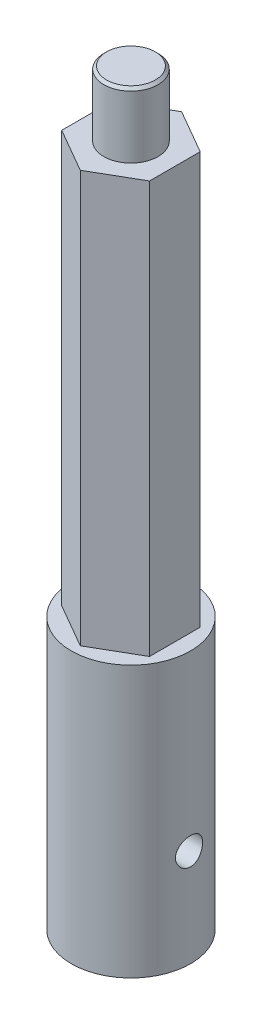
ISO-10303-21;
HEADER;
FILE_DESCRIPTION(('STEP AP214'),'2;1');
FILE_NAME('part.step','',(''),(''),'','','');
FILE_SCHEMA(('AUTOMOTIVE_DESIGN { 1 0 10303 214 1 1 1 1 }'));
ENDSEC;
DATA;
#1=APPLICATION_CONTEXT('core data for automotive mechanical design processes');
#2=APPLICATION_PROTOCOL_DEFINITION('international standard','automotive_design',2000,#1);
#3=PRODUCT_CONTEXT('',#1,'mechanical');
#4=PRODUCT('Part','Part','',(#3));
#5=PRODUCT_RELATED_PRODUCT_CATEGORY('part','',(#4));
#6=PRODUCT_DEFINITION_FORMATION('','',#4);
#7=PRODUCT_DEFINITION_CONTEXT('part definition',#1,'design');
#8=PRODUCT_DEFINITION('design','',#6,#7);
#9=PRODUCT_DEFINITION_SHAPE('','',#8);
#10=(LENGTH_UNIT() NAMED_UNIT(*) SI_UNIT(.MILLI.,.METRE.));
#11=(NAMED_UNIT(*) PLANE_ANGLE_UNIT() SI_UNIT($,.RADIAN.));
#12=(NAMED_UNIT(*) SI_UNIT($,.STERADIAN.) SOLID_ANGLE_UNIT());
#13=UNCERTAINTY_MEASURE_WITH_UNIT(LENGTH_MEASURE(1.E-05),#10,'distance_accuracy_value','');
#14=(GEOMETRIC_REPRESENTATION_CONTEXT(3) GLOBAL_UNCERTAINTY_ASSIGNED_CONTEXT((#13)) GLOBAL_UNIT_ASSIGNED_CONTEXT((#10,
#11,#12)) REPRESENTATION_CONTEXT('',''));
#15=CARTESIAN_POINT('',(0.,0.,0.));
#16=DIRECTION('',(0.,0.,1.));
#17=DIRECTION('',(1.,0.,0.));
#18=AXIS2_PLACEMENT_3D('',#15,#16,#17);
#19=CARTESIAN_POINT('',(2.5,15.,1.6583123951777));
#20=DIRECTION('',(1.,0.,0.));
#21=DIRECTION('',(0.,0.,-1.));
#22=AXIS2_PLACEMENT_3D('',#19,#20,#21);
#23=PLANE('',#22);
#24=CARTESIAN_POINT('',(2.5,9.,0.));
#25=DIRECTION('',(-1.,0.,0.));
#26=DIRECTION('',(0.,0.,1.));
#27=AXIS2_PLACEMENT_3D('',#24,#25,#26);
#28=CIRCLE('',#27,1.24999999999999);
#29=CARTESIAN_POINT('',(2.5,9.,1.24999999999999));
#30=VERTEX_POINT('',#29);
#31=EDGE_CURVE('E222',#30,#30,#28,.T.);
#32=ORIENTED_EDGE('',*,*,#31,.F.);
#33=EDGE_LOOP('',(#32));
#34=FACE_BOUND('',#33,.T.);
#35=DIRECTION('',(0.,0.,-1.));
#36=VECTOR('',#35,1.);
#37=CARTESIAN_POINT('',(2.5,3.,1.6583123951777));
#38=LINE('',#37,#36);
#39=CARTESIAN_POINT('',(2.5,3.,1.6583123951777));
#40=VERTEX_POINT('',#39);
#41=CARTESIAN_POINT('',(2.5,3.,-1.6583123951777));
#42=VERTEX_POINT('',#41);
#43=EDGE_CURVE('E11',#40,#42,#38,.T.);
#44=ORIENTED_EDGE('',*,*,#43,.F.);
#45=DIRECTION('',(0.,-1.,0.));
#46=VECTOR('',#45,1.);
#47=CARTESIAN_POINT('',(2.5,15.,1.6583123951777));
#48=LINE('',#47,#46);
#49=CARTESIAN_POINT('',(2.5,15.,1.6583123951777));
#50=VERTEX_POINT('',#49);
#51=EDGE_CURVE('E107',#50,#40,#48,.T.);
#52=ORIENTED_EDGE('',*,*,#51,.F.);
#53=DIRECTION('',(0.,0.,1.));
#54=VECTOR('',#53,1.);
#55=CARTESIAN_POINT('',(2.5,15.,1.6583123951777));
#56=LINE('',#55,#54);
#57=CARTESIAN_POINT('',(2.5,15.,-1.6583123951777));
#58=VERTEX_POINT('',#57);
#59=EDGE_CURVE('E113',#58,#50,#56,.T.);
#60=ORIENTED_EDGE('',*,*,#59,.F.);
#61=DIRECTION('',(0.,-1.,0.));
#62=VECTOR('',#61,1.);
#63=CARTESIAN_POINT('',(2.5,15.,-1.6583123951777));
#64=LINE('',#63,#62);
#65=EDGE_CURVE('E105',#58,#42,#64,.T.);
#66=ORIENTED_EDGE('',*,*,#65,.T.);
#67=EDGE_LOOP('',(#44,#52,#60,#66));
#68=FACE_BOUND('',#67,.T.);
#69=ADVANCED_FACE('F36',(#34,#68),#23,.F.);
#70=CARTESIAN_POINT('',(0.,63.,0.));
#71=DIRECTION('',(0.,1.,0.));
#72=DIRECTION('',(0.,0.,1.));
#73=AXIS2_PLACEMENT_3D('',#70,#71,#72);
#74=PLANE('',#73);
#75=DIRECTION('',(0.866025403784439,0.,0.5));
#76=VECTOR('',#75,1.);
#77=CARTESIAN_POINT('',(-4.05,63.,2.33826859021798));
#78=LINE('',#77,#76);
#79=CARTESIAN_POINT('',(-4.05,63.,2.33826859021798));
#80=VERTEX_POINT('',#79);
#81=CARTESIAN_POINT('',(0.,63.,4.67653718043597));
#82=VERTEX_POINT('',#81);
#83=EDGE_CURVE('E124',#80,#82,#78,.T.);
#84=ORIENTED_EDGE('',*,*,#83,.T.);
#85=DIRECTION('',(0.866025403784439,0.,-0.5));
#86=VECTOR('',#85,1.);
#87=CARTESIAN_POINT('',(0.,63.,4.67653718043597));
#88=LINE('',#87,#86);
#89=CARTESIAN_POINT('',(4.05,63.,2.33826859021799));
#90=VERTEX_POINT('',#89);
#91=EDGE_CURVE('E127',#82,#90,#88,.T.);
#92=ORIENTED_EDGE('',*,*,#91,.T.);
#93=DIRECTION('',(0.,0.,-1.));
#94=VECTOR('',#93,1.);
#95=CARTESIAN_POINT('',(4.05,63.,2.33826859021799));
#96=LINE('',#95,#94);
#97=CARTESIAN_POINT('',(4.05,63.,-2.33826859021799));
#98=VERTEX_POINT('',#97);
#99=EDGE_CURVE('E130',#90,#98,#96,.T.);
#100=ORIENTED_EDGE('',*,*,#99,.T.);
#101=DIRECTION('',(-0.866025403784439,0.,-0.5));
#102=VECTOR('',#101,1.);
#103=CARTESIAN_POINT('',(4.05,63.,-2.33826859021799));
#104=LINE('',#103,#102);
#105=CARTESIAN_POINT('',(0.,63.,-4.67653718043597));
#106=VERTEX_POINT('',#105);
#107=EDGE_CURVE('E132',#98,#106,#104,.T.);
#108=ORIENTED_EDGE('',*,*,#107,.T.);
#109=DIRECTION('',(-0.866025403784439,0.,0.5));
#110=VECTOR('',#109,1.);
#111=CARTESIAN_POINT('',(0.,63.,-4.67653718043597));
#112=LINE('',#111,#110);
#113=CARTESIAN_POINT('',(-4.05,63.,-2.33826859021798));
#114=VERTEX_POINT('',#113);
#115=EDGE_CURVE('E134',#106,#114,#112,.T.);
#116=ORIENTED_EDGE('',*,*,#115,.T.);
#117=DIRECTION('',(0.,0.,1.));
#118=VECTOR('',#117,1.);
#119=CARTESIAN_POINT('',(-4.05,63.,-2.33826859021798));
#120=LINE('',#119,#118);
#121=EDGE_CURVE('E136',#114,#80,#120,.T.);
#122=ORIENTED_EDGE('',*,*,#121,.T.);
#123=EDGE_LOOP('',(#84,#92,#100,#108,#116,#122));
#124=FACE_BOUND('',#123,.T.);
#125=CARTESIAN_POINT('',(0.,63.,0.));
#126=DIRECTION('',(0.,1.,0.));
#127=DIRECTION('',(0.,0.,1.));
#128=AXIS2_PLACEMENT_3D('',#125,#126,#127);
#129=CIRCLE('',#128,2.5);
#130=CARTESIAN_POINT('',(0.,63.,2.5));
#131=VERTEX_POINT('',#130);
#132=EDGE_CURVE('E115',#131,#131,#129,.T.);
#133=ORIENTED_EDGE('',*,*,#132,.F.);
#134=EDGE_LOOP('',(#133));
#135=FACE_BOUND('',#134,.T.);
#136=ADVANCED_FACE('F192',(#124,#135),#74,.T.);
#137=CARTESIAN_POINT('',(0.,25.,0.));
#138=DIRECTION('',(0.,1.,0.));
#139=DIRECTION('',(0.,0.,1.));
#140=AXIS2_PLACEMENT_3D('',#137,#138,#139);
#141=PLANE('',#140);
#142=CARTESIAN_POINT('',(0.,25.,0.));
#143=DIRECTION('',(0.,1.,0.));
#144=DIRECTION('',(0.,0.,1.));
#145=AXIS2_PLACEMENT_3D('',#142,#143,#144);
#146=CIRCLE('',#145,5.5);
#147=CARTESIAN_POINT('',(0.,25.,5.5));
#148=VERTEX_POINT('',#147);
#149=EDGE_CURVE('E165',#148,#148,#146,.T.);
#150=ORIENTED_EDGE('',*,*,#149,.T.);
#151=EDGE_LOOP('',(#150));
#152=FACE_BOUND('',#151,.T.);
#153=DIRECTION('',(0.866025403784439,0.,-0.5));
#154=VECTOR('',#153,1.);
#155=CARTESIAN_POINT('',(0.,25.,4.67653718043597));
#156=LINE('',#155,#154);
#157=CARTESIAN_POINT('',(0.,25.,4.67653718043597));
#158=VERTEX_POINT('',#157);
#159=CARTESIAN_POINT('',(4.05,25.,2.33826859021799));
#160=VERTEX_POINT('',#159);
#161=EDGE_CURVE('E141',#158,#160,#156,.T.);
#162=ORIENTED_EDGE('',*,*,#161,.F.);
#163=DIRECTION('',(0.866025403784439,0.,0.5));
#164=VECTOR('',#163,1.);
#165=CARTESIAN_POINT('',(-4.05,25.,2.33826859021798));
#166=LINE('',#165,#164);
#167=CARTESIAN_POINT('',(-4.05,25.,2.33826859021798));
#168=VERTEX_POINT('',#167);
#169=EDGE_CURVE('E123',#168,#158,#166,.T.);
#170=ORIENTED_EDGE('',*,*,#169,.F.);
#171=DIRECTION('',(0.,0.,1.));
#172=VECTOR('',#171,1.);
#173=CARTESIAN_POINT('',(-4.05,25.,-2.33826859021798));
#174=LINE('',#173,#172);
#175=CARTESIAN_POINT('',(-4.05,25.,-2.33826859021798));
#176=VERTEX_POINT('',#175);
#177=EDGE_CURVE('E128',#176,#168,#174,.T.);
#178=ORIENTED_EDGE('',*,*,#177,.F.);
#179=DIRECTION('',(-0.866025403784439,0.,0.5));
#180=VECTOR('',#179,1.);
#181=CARTESIAN_POINT('',(0.,25.,-4.67653718043597));
#182=LINE('',#181,#180);
#183=CARTESIAN_POINT('',(0.,25.,-4.67653718043597));
#184=VERTEX_POINT('',#183);
#185=EDGE_CURVE('E147',#184,#176,#182,.T.);
#186=ORIENTED_EDGE('',*,*,#185,.F.);
#187=DIRECTION('',(-0.866025403784439,0.,-0.5));
#188=VECTOR('',#187,1.);
#189=CARTESIAN_POINT('',(4.05,25.,-2.33826859021799));
#190=LINE('',#189,#188);
#191=CARTESIAN_POINT('',(4.05,25.,-2.33826859021799));
#192=VERTEX_POINT('',#191);
#193=EDGE_CURVE('E145',#192,#184,#190,.T.);
#194=ORIENTED_EDGE('',*,*,#193,.F.);
#195=DIRECTION('',(0.,0.,-1.));
#196=VECTOR('',#195,1.);
#197=CARTESIAN_POINT('',(4.05,25.,2.33826859021799));
#198=LINE('',#197,#196);
#199=EDGE_CURVE('E143',#160,#192,#198,.T.);
#200=ORIENTED_EDGE('',*,*,#199,.F.);
#201=EDGE_LOOP('',(#162,#170,#178,#186,#194,#200));
#202=FACE_BOUND('',#201,.T.);
#203=ADVANCED_FACE('F198',(#152,#202),#141,.T.);
#204=CARTESIAN_POINT('',(0.,25.,0.));
#205=DIRECTION('',(0.,-1.,0.));
#206=DIRECTION('',(0.,0.,-1.));
#207=AXIS2_PLACEMENT_3D('',#204,#205,#206);
#208=CYLINDRICAL_SURFACE('',#207,5.5);
#209=CARTESIAN_POINT('',(5.35607132140714,9.,1.24999999999999));
#210=CARTESIAN_POINT('',(5.35607271569806,9.06923309547632,1.24999771619422));
#211=CARTESIAN_POINT('',(5.35742832363105,9.13849304116834,1.24422856166961));
#212=CARTESIAN_POINT('',(5.36269332424885,9.27503828752842,1.2213326011839));
#213=CARTESIAN_POINT('',(5.3666044684747,9.34232220076731,1.20419800533182));
#214=CARTESIAN_POINT('',(5.3765152232523,9.47292052918666,1.15914270188604));
#215=CARTESIAN_POINT('',(5.38251243679928,9.53623940229246,1.13123436986437));
#216=CARTESIAN_POINT('',(5.39591668787014,9.65729919984067,1.0654598749522));
#217=CARTESIAN_POINT('',(5.4033237199606,9.71504014577908,1.0275937504387));
#218=CARTESIAN_POINT('',(5.41886390208649,9.82435774043544,0.942242640179423));
#219=CARTESIAN_POINT('',(5.42700696073142,9.87581789020527,0.894610220101116));
#220=CARTESIAN_POINT('',(5.44301514430799,9.97009125255459,0.791396730287177));
#221=CARTESIAN_POINT('',(5.45088024650588,10.0129037591972,0.735815012255045));
#222=CARTESIAN_POINT('',(5.465554705025,10.089131524136,0.617495106422171));
#223=CARTESIAN_POINT('',(5.47235100492417,10.1224341002153,0.554682564129413));
#224=CARTESIAN_POINT('',(5.48400988207614,10.1779667092065,0.424171927818219));
#225=CARTESIAN_POINT('',(5.48887269393571,10.2001980855652,0.356474427712259));
#226=CARTESIAN_POINT('',(5.49604666041601,10.2325890478744,0.219327796948698));
#227=CARTESIAN_POINT('',(5.49839948403379,10.2429459886787,0.149927493751898));
#228=CARTESIAN_POINT('',(5.50043296396436,10.2519117665406,0.0103372295205213));
#229=CARTESIAN_POINT('',(5.50011394929908,10.250522050133,-0.0598526332211519));
#230=CARTESIAN_POINT('',(5.49687132737987,10.2361796357133,-0.19766693545602));
#231=CARTESIAN_POINT('',(5.4939956555269,10.2234397359931,-0.265314815812263));
#232=CARTESIAN_POINT('',(5.48601775047252,10.1870984601743,-0.397486515579178));
#233=CARTESIAN_POINT('',(5.48091541149934,10.1634965681033,-0.462010186421012));
#234=CARTESIAN_POINT('',(5.4689813591498,10.1059172950664,-0.586684721878418));
#235=CARTESIAN_POINT('',(5.46213648824824,10.0718605496321,-0.646797621996532));
#236=CARTESIAN_POINT('',(5.44746585730485,9.99439774402204,-0.760531999783075));
#237=CARTESIAN_POINT('',(5.43963995384659,9.95099031620901,-0.814152526078437));
#238=CARTESIAN_POINT('',(5.42365855332192,9.85490429216835,-0.914646772136767));
#239=CARTESIAN_POINT('',(5.41549960097905,9.8020394945998,-0.961342074892386));
#240=CARTESIAN_POINT('',(5.39993520224881,9.68914459213129,-1.04523960036566));
#241=CARTESIAN_POINT('',(5.39252977972439,9.62911426044246,-1.08244152250121));
#242=CARTESIAN_POINT('',(5.37930083956819,9.50328800594513,-1.14638443688917));
#243=CARTESIAN_POINT('',(5.37348280157186,9.4374731230401,-1.17308932984504));
#244=CARTESIAN_POINT('',(5.36416156133669,9.30212572313035,-1.21500479464695));
#245=CARTESIAN_POINT('',(5.36065795929618,9.23259385045235,-1.23021735177407));
#246=CARTESIAN_POINT('',(5.35644447103176,9.09342287616907,-1.24843460096687));
#247=CARTESIAN_POINT('',(5.35567490508626,9.02381968359314,-1.25170012601046));
#248=CARTESIAN_POINT('',(5.35685524946336,8.88506339592736,-1.24663886357907));
#249=CARTESIAN_POINT('',(5.35880495678504,8.81591026762621,-1.2383129414362));
#250=CARTESIAN_POINT('',(5.36514758668855,8.68094085309581,-1.21053208830858));
#251=CARTESIAN_POINT('',(5.36950848562745,8.61509291659709,-1.19122293373318));
#252=CARTESIAN_POINT('',(5.38015285157009,8.48756720378463,-1.14218254768221));
#253=CARTESIAN_POINT('',(5.38643651447105,8.42588985316539,-1.11245025421961));
#254=CARTESIAN_POINT('',(5.40034808671371,8.30733348048033,-1.04284048047498));
#255=CARTESIAN_POINT('',(5.4079964833553,8.25055053047956,-1.00280355444637));
#256=CARTESIAN_POINT('',(5.42372272229399,8.14441334837699,-0.913927790878062));
#257=CARTESIAN_POINT('',(5.43180062228642,8.09506011774067,-0.865087768698981));
#258=CARTESIAN_POINT('',(5.44767387128745,8.00415945099209,-0.758807449059136));
#259=CARTESIAN_POINT('',(5.45546017266619,7.96279053763961,-0.701212876613625));
#260=CARTESIAN_POINT('',(5.46970150039047,7.89031459284748,-0.579740838143492));
#261=CARTESIAN_POINT('',(5.47615659136063,7.85920706321723,-0.515863677334323));
#262=CARTESIAN_POINT('',(5.48697029299492,7.80837979446002,-0.384052524657952));
#263=CARTESIAN_POINT('',(5.49134271843123,7.78858483630055,-0.316148723135446));
#264=CARTESIAN_POINT('',(5.49755837946589,7.76071172632286,-0.177868141541237));
#265=CARTESIAN_POINT('',(5.49940201371996,7.75263172766785,-0.107491753059364));
#266=CARTESIAN_POINT('',(5.50033936514418,7.74850644191406,0.0320463213642788));
#267=CARTESIAN_POINT('',(5.49949379441287,7.75219546074704,0.101199876219377));
#268=CARTESIAN_POINT('',(5.495279008056,7.77090547433905,0.237873894864678));
#269=CARTESIAN_POINT('',(5.49190984501223,7.78592623298895,0.305394392651151));
#270=CARTESIAN_POINT('',(5.48303224132098,7.82674181960574,0.436661017109416));
#271=CARTESIAN_POINT('',(5.47753183277209,7.852496222551,0.500420291420023));
#272=CARTESIAN_POINT('',(5.46497684589025,7.91400961342981,0.622746579339578));
#273=CARTESIAN_POINT('',(5.4579221040757,7.94976965384277,0.681313045870216));
#274=CARTESIAN_POINT('',(5.44284675668577,8.03113098232257,0.792878151421584));
#275=CARTESIAN_POINT('',(5.43480943945445,8.0769174572029,0.84573949073395));
#276=CARTESIAN_POINT('',(5.41876069975522,8.1766619851446,0.943119149892998));
#277=CARTESIAN_POINT('',(5.41074928407657,8.23062202727645,0.987635433020151));
#278=CARTESIAN_POINT('',(5.39552746381206,8.34613599692265,1.06769503602716));
#279=CARTESIAN_POINT('',(5.38833055874737,8.40778985648453,1.10309689858481));
#280=CARTESIAN_POINT('',(5.37572512012673,8.53632442568582,1.16298018793326));
#281=CARTESIAN_POINT('',(5.3703151279975,8.60320081700536,1.1874705270155));
#282=CARTESIAN_POINT('',(5.36285672020335,8.72508397872557,1.22064955230648));
#283=CARTESIAN_POINT('',(5.36032965084645,8.77944808628431,1.23163414148621));
#284=CARTESIAN_POINT('',(5.35693644077948,8.88920243590729,1.24631007168686));
#285=CARTESIAN_POINT('',(5.35607020555341,8.94459261939768,1.25000182773418));
#286=CARTESIAN_POINT('',(5.35607132140714,9.,1.24999999999999));
#287=B_SPLINE_CURVE_WITH_KNOTS('',3,(#209,#210,#211,#212,#213,#214,#215,#216,#217,#218,#219,
#220,#221,#222,#223,#224,#225,#226,#227,#228,#229,#230,#231,#232,#233,#234,#235,#236,#237,#238,
#239,#240,#241,#242,#243,#244,#245,#246,#247,#248,#249,#250,#251,#252,#253,#254,#255,#256,#257,
#258,#259,#260,#261,#262,#263,#264,#265,#266,#267,#268,#269,#270,#271,#272,#273,#274,#275,#276,
#277,#278,#279,#280,#281,#282,#283,#284,#285,#286),.UNSPECIFIED.,.T.,.F.,(4,2,2,2,2,2,2,2,2,2,2,
2,2,2,2,2,2,2,2,2,2,2,2,2,2,2,2,2,2,2,2,2,2,2,2,2,2,2,4),(0.,0.207496121650813,
0.415134608622388,0.622535291788398,0.829935175650528,1.04073318636021,1.25154839828979,
1.46476669375053,1.67795910969755,1.88755439091891,2.09712386203479,2.30284503333659,
2.50857597792602,2.71590898418402,2.92327233572577,3.13528932547435,3.3473130273321,
3.56005962984429,3.77276947234057,3.9808066511518,4.18882830027154,4.39415131138949,
4.59949524842832,4.80823060479208,5.01699407183281,5.22998962990618,5.44297484551384,
5.65452690065782,5.86604560147261,6.07282318924712,6.27959646870453,6.48559793754362,
6.69162108354877,6.90183008119011,7.11209031646656,7.32544005280885,7.53861520890217,
7.70468420860325,7.87074375724417),.UNSPECIFIED.);
#288=CARTESIAN_POINT('',(5.35607132140714,9.,1.24999999999999));
#289=VERTEX_POINT('',#288);
#290=EDGE_CURVE('E109',#289,#289,#287,.T.);
#291=ORIENTED_EDGE('',*,*,#290,.T.);
#292=EDGE_LOOP('',(#291));
#293=FACE_BOUND('',#292,.T.);
#294=ORIENTED_EDGE('',*,*,#149,.F.);
#295=EDGE_LOOP('',(#294));
#296=FACE_BOUND('',#295,.T.);
#297=CARTESIAN_POINT('',(0.,0.,0.));
#298=DIRECTION('',(0.,1.,0.));
#299=DIRECTION('',(0.,0.,1.));
#300=AXIS2_PLACEMENT_3D('',#297,#298,#299);
#301=CIRCLE('',#300,5.5);
#302=CARTESIAN_POINT('',(0.,0.,5.5));
#303=VERTEX_POINT('',#302);
#304=EDGE_CURVE('E164',#303,#303,#301,.T.);
#305=ORIENTED_EDGE('',*,*,#304,.T.);
#306=EDGE_LOOP('',(#305));
#307=FACE_BOUND('',#306,.T.);
#308=ADVANCED_FACE('F235',(#293,#296,#307),#208,.T.);
#309=CARTESIAN_POINT('',(0.,0.,0.));
#310=DIRECTION('',(0.,1.,0.));
#311=DIRECTION('',(0.,0.,1.));
#312=AXIS2_PLACEMENT_3D('',#309,#310,#311);
#313=PLANE('',#312);
#314=CARTESIAN_POINT('',(0.,0.,0.));
#315=DIRECTION('',(0.,-1.,0.));
#316=DIRECTION('',(0.,0.,-1.));
#317=AXIS2_PLACEMENT_3D('',#314,#315,#316);
#318=CIRCLE('',#317,3.);
#319=CARTESIAN_POINT('',(0.,0.,-3.));
#320=VERTEX_POINT('',#319);
#321=EDGE_CURVE('E108',#320,#320,#318,.T.);
#322=ORIENTED_EDGE('',*,*,#321,.F.);
#323=EDGE_LOOP('',(#322));
#324=FACE_BOUND('',#323,.T.);
#325=ORIENTED_EDGE('',*,*,#304,.F.);
#326=EDGE_LOOP('',(#325));
#327=FACE_BOUND('',#326,.T.);
#328=ADVANCED_FACE('F238',(#324,#327),#313,.F.);
#329=CARTESIAN_POINT('',(-4.05,63.,2.33826859021798));
#330=DIRECTION('',(0.5,0.,-0.866025403784439));
#331=DIRECTION('',(-0.866025403784439,0.,-0.5));
#332=AXIS2_PLACEMENT_3D('',#329,#330,#331);
#333=PLANE('',#332);
#334=ORIENTED_EDGE('',*,*,#169,.T.);
#335=DIRECTION('',(0.,-1.,0.));
#336=VECTOR('',#335,1.);
#337=CARTESIAN_POINT('',(0.,63.,4.67653718043597));
#338=LINE('',#337,#336);
#339=EDGE_CURVE('E162',#82,#158,#338,.T.);
#340=ORIENTED_EDGE('',*,*,#339,.F.);
#341=ORIENTED_EDGE('',*,*,#83,.F.);
#342=DIRECTION('',(0.,-1.,0.));
#343=VECTOR('',#342,1.);
#344=CARTESIAN_POINT('',(-4.05,63.,2.33826859021798));
#345=LINE('',#344,#343);
#346=EDGE_CURVE('E138',#80,#168,#345,.T.);
#347=ORIENTED_EDGE('',*,*,#346,.T.);
#348=EDGE_LOOP('',(#334,#340,#341,#347));
#349=FACE_BOUND('',#348,.T.);
#350=ADVANCED_FACE('F244',(#349),#333,.F.);
#351=CARTESIAN_POINT('',(0.,63.,4.67653718043597));
#352=DIRECTION('',(-0.5,0.,-0.866025403784439));
#353=DIRECTION('',(-0.866025403784439,0.,0.5));
#354=AXIS2_PLACEMENT_3D('',#351,#352,#353);
#355=PLANE('',#354);
#356=ORIENTED_EDGE('',*,*,#161,.T.);
#357=DIRECTION('',(0.,-1.,0.));
#358=VECTOR('',#357,1.);
#359=CARTESIAN_POINT('',(4.05,63.,2.33826859021799));
#360=LINE('',#359,#358);
#361=EDGE_CURVE('E159',#90,#160,#360,.T.);
#362=ORIENTED_EDGE('',*,*,#361,.F.);
#363=ORIENTED_EDGE('',*,*,#91,.F.);
#364=ORIENTED_EDGE('',*,*,#339,.T.);
#365=EDGE_LOOP('',(#356,#362,#363,#364));
#366=FACE_BOUND('',#365,.T.);
#367=ADVANCED_FACE('F249',(#366),#355,.F.);
#368=CARTESIAN_POINT('',(4.05,63.,2.33826859021799));
#369=DIRECTION('',(-1.,0.,0.));
#370=DIRECTION('',(0.,0.,1.));
#371=AXIS2_PLACEMENT_3D('',#368,#369,#370);
#372=PLANE('',#371);
#373=ORIENTED_EDGE('',*,*,#199,.T.);
#374=DIRECTION('',(0.,-1.,0.));
#375=VECTOR('',#374,1.);
#376=CARTESIAN_POINT('',(4.05,63.,-2.33826859021799));
#377=LINE('',#376,#375);
#378=EDGE_CURVE('E156',#98,#192,#377,.T.);
#379=ORIENTED_EDGE('',*,*,#378,.F.);
#380=ORIENTED_EDGE('',*,*,#99,.F.);
#381=ORIENTED_EDGE('',*,*,#361,.T.);
#382=EDGE_LOOP('',(#373,#379,#380,#381));
#383=FACE_BOUND('',#382,.T.);
#384=ADVANCED_FACE('F258',(#383),#372,.F.);
#385=CARTESIAN_POINT('',(4.05,63.,-2.33826859021799));
#386=DIRECTION('',(-0.5,0.,0.866025403784439));
#387=DIRECTION('',(0.866025403784439,0.,0.5));
#388=AXIS2_PLACEMENT_3D('',#385,#386,#387);
#389=PLANE('',#388);
#390=ORIENTED_EDGE('',*,*,#193,.T.);
#391=DIRECTION('',(0.,-1.,0.));
#392=VECTOR('',#391,1.);
#393=CARTESIAN_POINT('',(0.,63.,-4.67653718043597));
#394=LINE('',#393,#392);
#395=EDGE_CURVE('E153',#106,#184,#394,.T.);
#396=ORIENTED_EDGE('',*,*,#395,.F.);
#397=ORIENTED_EDGE('',*,*,#107,.F.);
#398=ORIENTED_EDGE('',*,*,#378,.T.);
#399=EDGE_LOOP('',(#390,#396,#397,#398));
#400=FACE_BOUND('',#399,.T.);
#401=ADVANCED_FACE('F262',(#400),#389,.F.);
#402=CARTESIAN_POINT('',(0.,63.,-4.67653718043597));
#403=DIRECTION('',(0.5,0.,0.866025403784439));
#404=DIRECTION('',(0.866025403784439,0.,-0.5));
#405=AXIS2_PLACEMENT_3D('',#402,#403,#404);
#406=PLANE('',#405);
#407=ORIENTED_EDGE('',*,*,#185,.T.);
#408=DIRECTION('',(0.,-1.,0.));
#409=VECTOR('',#408,1.);
#410=CARTESIAN_POINT('',(-4.05,63.,-2.33826859021798));
#411=LINE('',#410,#409);
#412=EDGE_CURVE('E57',#114,#176,#411,.T.);
#413=ORIENTED_EDGE('',*,*,#412,.F.);
#414=ORIENTED_EDGE('',*,*,#115,.F.);
#415=ORIENTED_EDGE('',*,*,#395,.T.);
#416=EDGE_LOOP('',(#407,#413,#414,#415));
#417=FACE_BOUND('',#416,.T.);
#418=ADVANCED_FACE('F266',(#417),#406,.F.);
#419=CARTESIAN_POINT('',(-4.05,63.,-2.33826859021798));
#420=DIRECTION('',(1.,0.,0.));
#421=DIRECTION('',(0.,0.,-1.));
#422=AXIS2_PLACEMENT_3D('',#419,#420,#421);
#423=PLANE('',#422);
#424=ORIENTED_EDGE('',*,*,#177,.T.);
#425=ORIENTED_EDGE('',*,*,#346,.F.);
#426=ORIENTED_EDGE('',*,*,#121,.F.);
#427=ORIENTED_EDGE('',*,*,#412,.T.);
#428=EDGE_LOOP('',(#424,#425,#426,#427));
#429=FACE_BOUND('',#428,.T.);
#430=ADVANCED_FACE('F188',(#429),#423,.F.);
#431=CARTESIAN_POINT('',(0.,69.,0.));
#432=DIRECTION('',(0.,-1.,0.));
#433=DIRECTION('',(0.,0.,-1.));
#434=AXIS2_PLACEMENT_3D('',#431,#432,#433);
#435=CYLINDRICAL_SURFACE('',#434,2.5);
#436=CARTESIAN_POINT('',(0.,68.75,0.));
#437=DIRECTION('',(0.,1.,0.));
#438=DIRECTION('',(0.,0.,1.));
#439=AXIS2_PLACEMENT_3D('',#436,#437,#438);
#440=CIRCLE('',#439,2.5);
#441=CARTESIAN_POINT('',(0.,68.75,2.5));
#442=VERTEX_POINT('',#441);
#443=EDGE_CURVE('E44',#442,#442,#440,.F.);
#444=ORIENTED_EDGE('',*,*,#443,.T.);
#445=EDGE_LOOP('',(#444));
#446=FACE_BOUND('',#445,.T.);
#447=ORIENTED_EDGE('',*,*,#132,.T.);
#448=EDGE_LOOP('',(#447));
#449=FACE_BOUND('',#448,.T.);
#450=ADVANCED_FACE('F175',(#446,#449),#435,.T.);
#451=CARTESIAN_POINT('',(0.,69.,0.));
#452=DIRECTION('',(0.,1.,0.));
#453=DIRECTION('',(0.,0.,1.));
#454=AXIS2_PLACEMENT_3D('',#451,#452,#453);
#455=PLANE('',#454);
#456=CARTESIAN_POINT('',(0.,69.,0.));
#457=DIRECTION('',(0.,1.,0.));
#458=DIRECTION('',(0.,0.,1.));
#459=AXIS2_PLACEMENT_3D('',#456,#457,#458);
#460=CIRCLE('',#459,2.24999999999999);
#461=CARTESIAN_POINT('',(0.,69.,2.24999999999999));
#462=VERTEX_POINT('',#461);
#463=EDGE_CURVE('E168',#462,#462,#460,.T.);
#464=ORIENTED_EDGE('',*,*,#463,.T.);
#465=EDGE_LOOP('',(#464));
#466=FACE_BOUND('',#465,.T.);
#467=ADVANCED_FACE('F180',(#466),#455,.T.);
#468=CARTESIAN_POINT('',(0.,69.,0.));
#469=DIRECTION('',(0.,-1.,0.));
#470=DIRECTION('',(0.,0.,-1.));
#471=AXIS2_PLACEMENT_3D('',#468,#469,#470);
#472=CONICAL_SURFACE('',#471,2.24999999999999,0.785398163397472);
#473=ORIENTED_EDGE('',*,*,#443,.F.);
#474=EDGE_LOOP('',(#473));
#475=FACE_BOUND('',#474,.T.);
#476=ORIENTED_EDGE('',*,*,#463,.F.);
#477=EDGE_LOOP('',(#476));
#478=FACE_BOUND('',#477,.T.);
#479=ADVANCED_FACE('F38',(#475,#478),#472,.T.);
#480=CARTESIAN_POINT('',(0.,15.,0.));
#481=DIRECTION('',(0.,-1.,0.));
#482=DIRECTION('',(0.,0.,-1.));
#483=AXIS2_PLACEMENT_3D('',#480,#481,#482);
#484=CYLINDRICAL_SURFACE('',#483,3.);
#485=ORIENTED_EDGE('',*,*,#321,.T.);
#486=EDGE_LOOP('',(#485));
#487=FACE_BOUND('',#486,.T.);
#488=CARTESIAN_POINT('',(0.,3.,0.));
#489=DIRECTION('',(0.,-1.,0.));
#490=DIRECTION('',(0.,0.,-1.));
#491=AXIS2_PLACEMENT_3D('',#488,#489,#490);
#492=CIRCLE('',#491,3.);
#493=EDGE_CURVE('E49',#42,#40,#492,.T.);
#494=ORIENTED_EDGE('',*,*,#493,.F.);
#495=ORIENTED_EDGE('',*,*,#65,.F.);
#496=CARTESIAN_POINT('',(0.,15.,0.));
#497=DIRECTION('',(0.,-1.,0.));
#498=DIRECTION('',(0.,0.,-1.));
#499=AXIS2_PLACEMENT_3D('',#496,#497,#498);
#500=CIRCLE('',#499,3.);
#501=EDGE_CURVE('E117',#50,#58,#500,.T.);
#502=ORIENTED_EDGE('',*,*,#501,.F.);
#503=ORIENTED_EDGE('',*,*,#51,.T.);
#504=EDGE_LOOP('',(#494,#495,#502,#503));
#505=FACE_BOUND('',#504,.T.);
#506=ADVANCED_FACE('F103',(#487,#505),#484,.F.);
#507=CARTESIAN_POINT('',(0.,15.,0.));
#508=DIRECTION('',(0.,-1.,0.));
#509=DIRECTION('',(0.,0.,-1.));
#510=AXIS2_PLACEMENT_3D('',#507,#508,#509);
#511=PLANE('',#510);
#512=ORIENTED_EDGE('',*,*,#501,.T.);
#513=ORIENTED_EDGE('',*,*,#59,.T.);
#514=EDGE_LOOP('',(#512,#513));
#515=FACE_BOUND('',#514,.T.);
#516=ADVANCED_FACE('F203',(#515),#511,.T.);
#517=CARTESIAN_POINT('',(0.,3.,0.));
#518=DIRECTION('',(0.,-1.,0.));
#519=DIRECTION('',(0.,0.,-1.));
#520=AXIS2_PLACEMENT_3D('',#517,#518,#519);
#521=PLANE('',#520);
#522=ORIENTED_EDGE('',*,*,#43,.T.);
#523=ORIENTED_EDGE('',*,*,#493,.T.);
#524=EDGE_LOOP('',(#522,#523));
#525=FACE_BOUND('',#524,.T.);
#526=ADVANCED_FACE('F98',(#525),#521,.T.);
#527=CARTESIAN_POINT('',(2.5,9.,0.));
#528=DIRECTION('',(-1.,0.,0.));
#529=DIRECTION('',(0.,0.,1.));
#530=AXIS2_PLACEMENT_3D('',#527,#528,#529);
#531=CYLINDRICAL_SURFACE('',#530,1.24999999999999);
#532=ORIENTED_EDGE('',*,*,#290,.F.);
#533=EDGE_LOOP('',(#532));
#534=FACE_BOUND('',#533,.T.);
#535=ORIENTED_EDGE('',*,*,#31,.T.);
#536=EDGE_LOOP('',(#535));
#537=FACE_BOUND('',#536,.T.);
#538=ADVANCED_FACE('F224',(#534,#537),#531,.F.);
#539=CLOSED_SHELL('',(#69,#136,#203,#308,#328,#350,#367,#384,#401,#418,#430,#450,#467,#479,#506,
#516,#526,#538));
#540=MANIFOLD_SOLID_BREP('B2',#539);
#541=ADVANCED_BREP_SHAPE_REPRESENTATION('',(#18,#540),#14);
#542=SHAPE_DEFINITION_REPRESENTATION(#9,#541);
ENDSEC;
END-ISO-10303-21;
